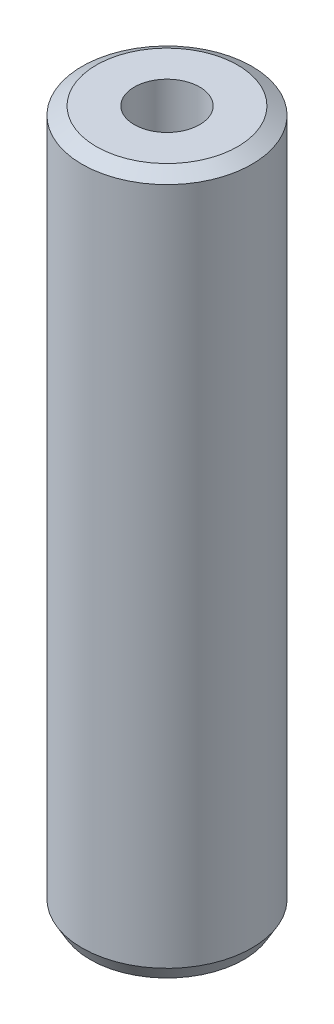
ISO-10303-21;
HEADER;
FILE_DESCRIPTION(('STEP AP214'),'2;1');
FILE_NAME('part.step','',(''),(''),'','','');
FILE_SCHEMA(('AUTOMOTIVE_DESIGN { 1 0 10303 214 1 1 1 1 }'));
ENDSEC;
DATA;
#1=APPLICATION_CONTEXT('core data for automotive mechanical design processes');
#2=APPLICATION_PROTOCOL_DEFINITION('international standard','automotive_design',2000,#1);
#3=PRODUCT_CONTEXT('',#1,'mechanical');
#4=PRODUCT('Part','Part','',(#3));
#5=PRODUCT_RELATED_PRODUCT_CATEGORY('part','',(#4));
#6=PRODUCT_DEFINITION_FORMATION('','',#4);
#7=PRODUCT_DEFINITION_CONTEXT('part definition',#1,'design');
#8=PRODUCT_DEFINITION('design','',#6,#7);
#9=PRODUCT_DEFINITION_SHAPE('','',#8);
#10=(LENGTH_UNIT() NAMED_UNIT(*) SI_UNIT(.MILLI.,.METRE.));
#11=(NAMED_UNIT(*) PLANE_ANGLE_UNIT() SI_UNIT($,.RADIAN.));
#12=(NAMED_UNIT(*) SI_UNIT($,.STERADIAN.) SOLID_ANGLE_UNIT());
#13=UNCERTAINTY_MEASURE_WITH_UNIT(LENGTH_MEASURE(1.E-05),#10,'distance_accuracy_value','');
#14=(GEOMETRIC_REPRESENTATION_CONTEXT(3) GLOBAL_UNCERTAINTY_ASSIGNED_CONTEXT((#13)) GLOBAL_UNIT_ASSIGNED_CONTEXT((#10,
#11,#12)) REPRESENTATION_CONTEXT('',''));
#15=CARTESIAN_POINT('',(0.,0.,0.));
#16=DIRECTION('',(0.,0.,1.));
#17=DIRECTION('',(1.,0.,0.));
#18=AXIS2_PLACEMENT_3D('',#15,#16,#17);
#19=CARTESIAN_POINT('',(0.,371.531253070788,0.));
#20=DIRECTION('',(0.,-1.,0.));
#21=DIRECTION('',(0.,0.,-1.));
#22=AXIS2_PLACEMENT_3D('',#19,#20,#21);
#23=CYLINDRICAL_SURFACE('',#22,45.);
#24=CARTESIAN_POINT('',(0.,367.183094553471,0.));
#25=DIRECTION('',(0.,1.,0.));
#26=DIRECTION('',(0.,0.,1.));
#27=AXIS2_PLACEMENT_3D('',#24,#25,#26);
#28=CIRCLE('',#27,45.);
#29=CARTESIAN_POINT('',(0.,367.183094553471,45.));
#30=VERTEX_POINT('',#29);
#31=EDGE_CURVE('E50',#30,#30,#28,.F.);
#32=ORIENTED_EDGE('',*,*,#31,.T.);
#33=EDGE_LOOP('',(#32));
#34=FACE_BOUND('',#33,.T.);
#35=CARTESIAN_POINT('',(0.,7.53123147135604,0.));
#36=DIRECTION('',(0.,1.,0.));
#37=DIRECTION('',(0.,0.,1.));
#38=AXIS2_PLACEMENT_3D('',#35,#36,#37);
#39=CIRCLE('',#38,45.);
#40=CARTESIAN_POINT('',(0.,7.53123147135604,45.));
#41=VERTEX_POINT('',#40);
#42=EDGE_CURVE('E51',#41,#41,#39,.T.);
#43=ORIENTED_EDGE('',*,*,#42,.T.);
#44=EDGE_LOOP('',(#43));
#45=FACE_BOUND('',#44,.T.);
#46=ADVANCED_FACE('F39',(#34,#45),#23,.T.);
#47=CARTESIAN_POINT('',(0.,371.531253070788,0.));
#48=DIRECTION('',(0.,1.,0.));
#49=DIRECTION('',(0.,0.,1.));
#50=AXIS2_PLACEMENT_3D('',#47,#48,#49);
#51=PLANE('',#50);
#52=CARTESIAN_POINT('',(0.,371.531253070788,0.));
#53=DIRECTION('',(0.,1.,0.));
#54=DIRECTION('',(0.,0.,1.));
#55=AXIS2_PLACEMENT_3D('',#52,#53,#54);
#56=CIRCLE('',#55,37.4687685286442);
#57=CARTESIAN_POINT('',(0.,371.531253070788,37.4687685286442));
#58=VERTEX_POINT('',#57);
#59=EDGE_CURVE('E54',#58,#58,#56,.T.);
#60=ORIENTED_EDGE('',*,*,#59,.T.);
#61=EDGE_LOOP('',(#60));
#62=FACE_BOUND('',#61,.T.);
#63=CARTESIAN_POINT('',(0.,371.531253070788,0.));
#64=DIRECTION('',(0.,1.,0.));
#65=DIRECTION('',(0.,0.,1.));
#66=AXIS2_PLACEMENT_3D('',#63,#64,#65);
#67=CIRCLE('',#66,17.3185543239045);
#68=CARTESIAN_POINT('',(0.,371.531253070788,17.3185543239045));
#69=VERTEX_POINT('',#68);
#70=EDGE_CURVE('E58',#69,#69,#67,.T.);
#71=ORIENTED_EDGE('',*,*,#70,.F.);
#72=EDGE_LOOP('',(#71));
#73=FACE_BOUND('',#72,.T.);
#74=ADVANCED_FACE('F69',(#62,#73),#51,.T.);
#75=CARTESIAN_POINT('',(0.,0.,0.));
#76=DIRECTION('',(0.,1.,0.));
#77=DIRECTION('',(0.,0.,1.));
#78=AXIS2_PLACEMENT_3D('',#75,#76,#77);
#79=PLANE('',#78);
#80=CARTESIAN_POINT('',(0.,0.,0.));
#81=DIRECTION('',(0.,1.,0.));
#82=DIRECTION('',(0.,0.,1.));
#83=AXIS2_PLACEMENT_3D('',#80,#81,#82);
#84=CIRCLE('',#83,40.6518414826832);
#85=CARTESIAN_POINT('',(0.,0.,40.6518414826832));
#86=VERTEX_POINT('',#85);
#87=EDGE_CURVE('E10',#86,#86,#84,.F.);
#88=ORIENTED_EDGE('',*,*,#87,.T.);
#89=EDGE_LOOP('',(#88));
#90=FACE_BOUND('',#89,.T.);
#91=CARTESIAN_POINT('',(0.,0.,0.));
#92=DIRECTION('',(0.,1.,0.));
#93=DIRECTION('',(0.,0.,1.));
#94=AXIS2_PLACEMENT_3D('',#91,#92,#93);
#95=CIRCLE('',#94,17.3185543239045);
#96=CARTESIAN_POINT('',(0.,0.,17.3185543239045));
#97=VERTEX_POINT('',#96);
#98=EDGE_CURVE('E63',#97,#97,#95,.T.);
#99=ORIENTED_EDGE('',*,*,#98,.T.);
#100=EDGE_LOOP('',(#99));
#101=FACE_BOUND('',#100,.T.);
#102=ADVANCED_FACE('F75',(#90,#101),#79,.F.);
#103=CARTESIAN_POINT('',(0.,371.531253070788,0.));
#104=DIRECTION('',(0.,-1.,0.));
#105=DIRECTION('',(0.,0.,-1.));
#106=AXIS2_PLACEMENT_3D('',#103,#104,#105);
#107=CYLINDRICAL_SURFACE('',#106,17.3185543239045);
#108=ORIENTED_EDGE('',*,*,#70,.T.);
#109=EDGE_LOOP('',(#108));
#110=FACE_BOUND('',#109,.T.);
#111=ORIENTED_EDGE('',*,*,#98,.F.);
#112=EDGE_LOOP('',(#111));
#113=FACE_BOUND('',#112,.T.);
#114=ADVANCED_FACE('F70',(#110,#113),#107,.F.);
#115=CARTESIAN_POINT('',(0.,371.531253070788,0.));
#116=DIRECTION('',(0.,-1.,0.));
#117=DIRECTION('',(0.,0.,-1.));
#118=AXIS2_PLACEMENT_3D('',#115,#116,#117);
#119=CONICAL_SURFACE('',#118,37.4687685286442,1.0471975511966);
#120=ORIENTED_EDGE('',*,*,#31,.F.);
#121=EDGE_LOOP('',(#120));
#122=FACE_BOUND('',#121,.T.);
#123=ORIENTED_EDGE('',*,*,#59,.F.);
#124=EDGE_LOOP('',(#123));
#125=FACE_BOUND('',#124,.T.);
#126=ADVANCED_FACE('F81',(#122,#125),#119,.T.);
#127=CARTESIAN_POINT('',(0.,7.53123147135604,0.));
#128=DIRECTION('',(0.,1.,0.));
#129=DIRECTION('',(0.,0.,1.));
#130=AXIS2_PLACEMENT_3D('',#127,#128,#129);
#131=CONICAL_SURFACE('',#130,45.,0.523598775598304);
#132=CARTESIAN_POINT('',(0.,0.,40.6518414826832));
#133=CARTESIAN_POINT('',(0.,0.0784503278266246,40.6971348005719));
#134=CARTESIAN_POINT('',(0.,0.15690065565325,40.7424281184606));
#135=CARTESIAN_POINT('',(0.,0.313801311306501,40.833014754238));
#136=CARTESIAN_POINT('',(0.,0.392251639133126,40.8783080721267));
#137=CARTESIAN_POINT('',(0.,0.549152294786377,40.9688947079042));
#138=CARTESIAN_POINT('',(0.,0.627602622613002,41.0141880257929));
#139=CARTESIAN_POINT('',(0.,0.784503278266253,41.1047746615703));
#140=CARTESIAN_POINT('',(0.,0.862953606092878,41.1500679794591));
#141=CARTESIAN_POINT('',(0.,1.01985426174613,41.2406546152365));
#142=CARTESIAN_POINT('',(0.,1.09830458957275,41.2859479331252));
#143=CARTESIAN_POINT('',(0.,1.25520524522601,41.3765345689026));
#144=CARTESIAN_POINT('',(0.,1.33365557305263,41.4218278867914));
#145=CARTESIAN_POINT('',(0.,1.49055622870588,41.5124145225688));
#146=CARTESIAN_POINT('',(0.,1.56900655653251,41.5577078404575));
#147=CARTESIAN_POINT('',(0.,1.72590721218576,41.6482944762349));
#148=CARTESIAN_POINT('',(0.,1.80435754001238,41.6935877941237));
#149=CARTESIAN_POINT('',(0.,1.96125819566563,41.7841744299011));
#150=CARTESIAN_POINT('',(0.,2.03970852349226,41.8294677477898));
#151=CARTESIAN_POINT('',(0.,2.19660917914551,41.9200543835672));
#152=CARTESIAN_POINT('',(0.,2.27505950697214,41.965347701456));
#153=CARTESIAN_POINT('',(0.,2.43196016262539,42.0559343372334));
#154=CARTESIAN_POINT('',(0.,2.51041049045201,42.1012276551221));
#155=CARTESIAN_POINT('',(0.,2.66731114610526,42.1918142908996));
#156=CARTESIAN_POINT('',(0.,2.74576147393189,42.2371076087883));
#157=CARTESIAN_POINT('',(0.,2.90266212958514,42.3276942445657));
#158=CARTESIAN_POINT('',(0.,2.98111245741176,42.3729875624544));
#159=CARTESIAN_POINT('',(0.,3.13801311306502,42.4635741982319));
#160=CARTESIAN_POINT('',(0.,3.21646344089164,42.5088675161206));
#161=CARTESIAN_POINT('',(0.,3.37336409654489,42.599454151898));
#162=CARTESIAN_POINT('',(0.,3.45181442437152,42.6447474697867));
#163=CARTESIAN_POINT('',(0.,3.60871508002477,42.7353341055641));
#164=CARTESIAN_POINT('',(0.,3.68716540785139,42.7806274234529));
#165=CARTESIAN_POINT('',(0.,3.84406606350464,42.8712140592303));
#166=CARTESIAN_POINT('',(0.,3.92251639133127,42.916507377119));
#167=CARTESIAN_POINT('',(0.,4.07941704698452,43.0070940128965));
#168=CARTESIAN_POINT('',(0.,4.15786737481115,43.0523873307852));
#169=CARTESIAN_POINT('',(0.,4.3147680304644,43.1429739665626));
#170=CARTESIAN_POINT('',(0.,4.39321835829102,43.1882672844513));
#171=CARTESIAN_POINT('',(0.,4.55011901394427,43.2788539202288));
#172=CARTESIAN_POINT('',(0.,4.6285693417709,43.3241472381175));
#173=CARTESIAN_POINT('',(0.,4.78546999742415,43.4147338738949));
#174=CARTESIAN_POINT('',(0.,4.86392032525077,43.4600271917836));
#175=CARTESIAN_POINT('',(0.,5.02082098090402,43.5506138275611));
#176=CARTESIAN_POINT('',(0.,5.09927130873065,43.5959071454498));
#177=CARTESIAN_POINT('',(0.,5.2561719643839,43.6864937812272));
#178=CARTESIAN_POINT('',(0.,5.33462229221053,43.7317870991159));
#179=CARTESIAN_POINT('',(0.,5.49152294786378,43.8223737348934));
#180=CARTESIAN_POINT('',(0.,5.5699732756904,43.8676670527821));
#181=CARTESIAN_POINT('',(0.,5.72687393134365,43.9582536885595));
#182=CARTESIAN_POINT('',(0.,5.80532425917028,44.0035470064482));
#183=CARTESIAN_POINT('',(0.,5.96222491482353,44.0941336422257));
#184=CARTESIAN_POINT('',(0.,6.04067524265015,44.1394269601144));
#185=CARTESIAN_POINT('',(0.,6.19757589830341,44.2300135958918));
#186=CARTESIAN_POINT('',(0.,6.27602622613003,44.2753069137805));
#187=CARTESIAN_POINT('',(0.,6.43292688178328,44.365893549558));
#188=CARTESIAN_POINT('',(0.,6.51137720960991,44.4111868674467));
#189=CARTESIAN_POINT('',(0.,6.66827786526316,44.5017735032241));
#190=CARTESIAN_POINT('',(0.,6.74672819308978,44.5470668211128));
#191=CARTESIAN_POINT('',(0.,6.90362884874303,44.6376534568903));
#192=CARTESIAN_POINT('',(0.,6.98207917656966,44.682946774779));
#193=CARTESIAN_POINT('',(0.,7.13897983222291,44.7735334105564));
#194=CARTESIAN_POINT('',(0.,7.21743016004954,44.8188267284451));
#195=CARTESIAN_POINT('',(0.,7.37433081570279,44.9094133642226));
#196=CARTESIAN_POINT('',(0.,7.45278114352941,44.9547066821113));
#197=CARTESIAN_POINT('',(0.,7.53123147135604,45.));
#198=B_SPLINE_CURVE_WITH_KNOTS('',3,(#132,#133,#134,#135,#136,#137,#138,#139,#140,#141,#142,
#143,#144,#145,#146,#147,#148,#149,#150,#151,#152,#153,#154,#155,#156,#157,#158,#159,#160,#161,
#162,#163,#164,#165,#166,#167,#168,#169,#170,#171,#172,#173,#174,#175,#176,#177,#178,#179,#180,
#181,#182,#183,#184,#185,#186,#187,#188,#189,#190,#191,#192,#193,#194,#195,#196,#197),
.UNSPECIFIED.,.F.,.F.,(4,2,2,2,2,2,2,2,2,2,2,2,2,2,2,2,2,2,2,2,2,2,2,2,2,2,2,2,2,2,2,2,4),(0.,
0.2717599073323,0.5435198146646,0.815279721996901,1.0870396293292,1.3587995366615,
1.6305594439938,1.9023193513261,2.1740792586584,2.4458391659907,2.717599073323,2.9893589806553,
3.2611188879876,3.5328787953199,3.8046387026522,4.0763986099845,4.3481585173168,4.6199184246491,
4.8916783319814,5.1634382393137,5.435198146646,5.7069580539783,5.9787179613106,6.2504778686429,
6.5222377759752,6.7939976833075,7.0657575906398,7.3375174979721,7.6092774053044,
7.88103731263671,8.152797219969,8.4245571273013,8.6963170346336),.UNSPECIFIED.);
#199=EDGE_CURVE('BSEAM45',#86,#41,#198,.T.);
#200=ORIENTED_EDGE('',*,*,#87,.F.);
#201=ORIENTED_EDGE('',*,*,#42,.F.);
#202=ORIENTED_EDGE('',*,*,#199,.T.);
#203=ORIENTED_EDGE('',*,*,#199,.F.);
#204=EDGE_LOOP('',(#200,#202,#201,#203));
#205=FACE_BOUND('',#204,.T.);
#206=ADVANCED_FACE('F45',(#205),#131,.T.);
#207=CLOSED_SHELL('',(#46,#74,#102,#114,#126,#206));
#208=MANIFOLD_SOLID_BREP('B2',#207);
#209=ADVANCED_BREP_SHAPE_REPRESENTATION('',(#18,#208),#14);
#210=SHAPE_DEFINITION_REPRESENTATION(#9,#209);
ENDSEC;
END-ISO-10303-21;
